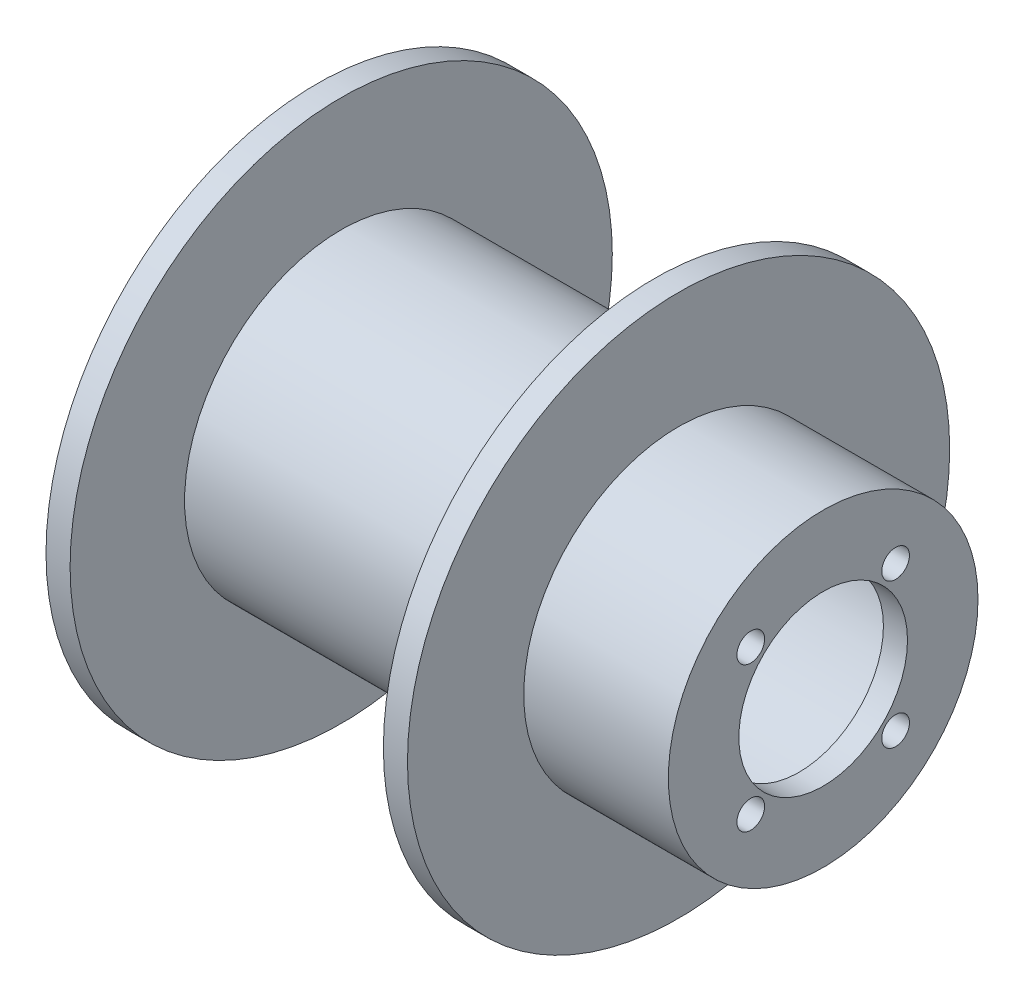
ISO-10303-21;
HEADER;
FILE_DESCRIPTION(('STEP AP214'),'2;1');
FILE_NAME('part.step','',(''),(''),'','','');
FILE_SCHEMA(('AUTOMOTIVE_DESIGN { 1 0 10303 214 1 1 1 1 }'));
ENDSEC;
DATA;
#1=APPLICATION_CONTEXT('core data for automotive mechanical design processes');
#2=APPLICATION_PROTOCOL_DEFINITION('international standard','automotive_design',2000,#1);
#3=PRODUCT_CONTEXT('',#1,'mechanical');
#4=PRODUCT('Part','Part','',(#3));
#5=PRODUCT_RELATED_PRODUCT_CATEGORY('part','',(#4));
#6=PRODUCT_DEFINITION_FORMATION('','',#4);
#7=PRODUCT_DEFINITION_CONTEXT('part definition',#1,'design');
#8=PRODUCT_DEFINITION('design','',#6,#7);
#9=PRODUCT_DEFINITION_SHAPE('','',#8);
#10=(LENGTH_UNIT() NAMED_UNIT(*) SI_UNIT(.MILLI.,.METRE.));
#11=(NAMED_UNIT(*) PLANE_ANGLE_UNIT() SI_UNIT($,.RADIAN.));
#12=(NAMED_UNIT(*) SI_UNIT($,.STERADIAN.) SOLID_ANGLE_UNIT());
#13=UNCERTAINTY_MEASURE_WITH_UNIT(LENGTH_MEASURE(1.E-05),#10,'distance_accuracy_value','');
#14=(GEOMETRIC_REPRESENTATION_CONTEXT(3) GLOBAL_UNCERTAINTY_ASSIGNED_CONTEXT((#13)) GLOBAL_UNIT_ASSIGNED_CONTEXT((#10,
#11,#12)) REPRESENTATION_CONTEXT('',''));
#15=CARTESIAN_POINT('',(0.,0.,0.));
#16=DIRECTION('',(0.,0.,1.));
#17=DIRECTION('',(1.,0.,0.));
#18=AXIS2_PLACEMENT_3D('',#15,#16,#17);
#19=CARTESIAN_POINT('',(-42.,0.,0.));
#20=DIRECTION('',(1.,0.,0.));
#21=DIRECTION('',(0.,0.,-1.));
#22=AXIS2_PLACEMENT_3D('',#19,#20,#21);
#23=CYLINDRICAL_SURFACE('',#22,22.5);
#24=CARTESIAN_POINT('',(-42.,0.,0.));
#25=DIRECTION('',(1.,0.,0.));
#26=DIRECTION('',(0.,0.,-1.));
#27=AXIS2_PLACEMENT_3D('',#24,#25,#26);
#28=CIRCLE('',#27,22.5);
#29=CARTESIAN_POINT('',(-42.,0.,-22.5));
#30=VERTEX_POINT('',#29);
#31=EDGE_CURVE('E12',#30,#30,#28,.T.);
#32=ORIENTED_EDGE('',*,*,#31,.T.);
#33=EDGE_LOOP('',(#32));
#34=FACE_BOUND('',#33,.T.);
#35=CARTESIAN_POINT('',(-40.,0.,0.));
#36=DIRECTION('',(1.,0.,0.));
#37=DIRECTION('',(0.,0.,-1.));
#38=AXIS2_PLACEMENT_3D('',#35,#36,#37);
#39=CIRCLE('',#38,22.5);
#40=CARTESIAN_POINT('',(-40.,0.,-22.5));
#41=VERTEX_POINT('',#40);
#42=EDGE_CURVE('E56',#41,#41,#39,.T.);
#43=ORIENTED_EDGE('',*,*,#42,.F.);
#44=EDGE_LOOP('',(#43));
#45=FACE_BOUND('',#44,.T.);
#46=ADVANCED_FACE('F53',(#34,#45),#23,.T.);
#47=CARTESIAN_POINT('',(-42.,0.,0.));
#48=DIRECTION('',(1.,0.,0.));
#49=DIRECTION('',(0.,0.,-1.));
#50=AXIS2_PLACEMENT_3D('',#47,#48,#49);
#51=PLANE('',#50);
#52=CARTESIAN_POINT('',(-42.,0.,0.));
#53=DIRECTION('',(1.,0.,0.));
#54=DIRECTION('',(0.,0.,-1.));
#55=AXIS2_PLACEMENT_3D('',#52,#53,#54);
#56=CIRCLE('',#55,12.);
#57=CARTESIAN_POINT('',(-42.,0.,-12.));
#58=VERTEX_POINT('',#57);
#59=EDGE_CURVE('E63',#58,#58,#56,.T.);
#60=ORIENTED_EDGE('',*,*,#59,.T.);
#61=EDGE_LOOP('',(#60));
#62=FACE_BOUND('',#61,.T.);
#63=ORIENTED_EDGE('',*,*,#31,.F.);
#64=EDGE_LOOP('',(#63));
#65=FACE_BOUND('',#64,.T.);
#66=ADVANCED_FACE('F71',(#62,#65),#51,.F.);
#67=CARTESIAN_POINT('',(-40.,0.,0.));
#68=DIRECTION('',(1.,0.,0.));
#69=DIRECTION('',(0.,0.,-1.));
#70=AXIS2_PLACEMENT_3D('',#67,#68,#69);
#71=PLANE('',#70);
#72=CARTESIAN_POINT('',(-40.,0.,0.));
#73=DIRECTION('',(1.,0.,0.));
#74=DIRECTION('',(0.,0.,-1.));
#75=AXIS2_PLACEMENT_3D('',#72,#73,#74);
#76=CIRCLE('',#75,12.);
#77=CARTESIAN_POINT('',(-40.,0.,-12.));
#78=VERTEX_POINT('',#77);
#79=EDGE_CURVE('E65',#78,#78,#76,.T.);
#80=ORIENTED_EDGE('',*,*,#79,.F.);
#81=EDGE_LOOP('',(#80));
#82=FACE_BOUND('',#81,.T.);
#83=ORIENTED_EDGE('',*,*,#42,.T.);
#84=EDGE_LOOP('',(#83));
#85=FACE_BOUND('',#84,.T.);
#86=ADVANCED_FACE('F77',(#82,#85),#71,.T.);
#87=CARTESIAN_POINT('',(-42.,0.,0.));
#88=DIRECTION('',(1.,0.,0.));
#89=DIRECTION('',(0.,0.,-1.));
#90=AXIS2_PLACEMENT_3D('',#87,#88,#89);
#91=CYLINDRICAL_SURFACE('',#90,12.);
#92=ORIENTED_EDGE('',*,*,#59,.F.);
#93=EDGE_LOOP('',(#92));
#94=FACE_BOUND('',#93,.T.);
#95=ORIENTED_EDGE('',*,*,#79,.T.);
#96=EDGE_LOOP('',(#95));
#97=FACE_BOUND('',#96,.T.);
#98=ADVANCED_FACE('F74',(#94,#97),#91,.F.);
#99=CLOSED_SHELL('',(#46,#66,#86,#98));
#100=MANIFOLD_SOLID_BREP('B2',#99);
#101=CARTESIAN_POINT('',(-14.,0.,0.));
#102=DIRECTION('',(1.,0.,0.));
#103=DIRECTION('',(0.,0.,-1.));
#104=AXIS2_PLACEMENT_3D('',#101,#102,#103);
#105=CYLINDRICAL_SURFACE('',#104,12.);
#106=CARTESIAN_POINT('',(-2.,0.,0.));
#107=DIRECTION('',(1.,0.,0.));
#108=DIRECTION('',(0.,0.,-1.));
#109=AXIS2_PLACEMENT_3D('',#106,#107,#108);
#110=CIRCLE('',#109,12.);
#111=CARTESIAN_POINT('',(-2.,0.,-12.));
#112=VERTEX_POINT('',#111);
#113=EDGE_CURVE('E131',#112,#112,#110,.F.);
#114=ORIENTED_EDGE('',*,*,#113,.F.);
#115=EDGE_LOOP('',(#114));
#116=FACE_BOUND('',#115,.T.);
#117=CARTESIAN_POINT('',(-40.,0.,0.));
#118=DIRECTION('',(1.,0.,0.));
#119=DIRECTION('',(0.,0.,-1.));
#120=AXIS2_PLACEMENT_3D('',#117,#118,#119);
#121=CIRCLE('',#120,12.);
#122=CARTESIAN_POINT('',(-40.,0.,-12.));
#123=VERTEX_POINT('',#122);
#124=EDGE_CURVE('E156',#123,#123,#121,.T.);
#125=ORIENTED_EDGE('',*,*,#124,.F.);
#126=EDGE_LOOP('',(#125));
#127=FACE_BOUND('',#126,.T.);
#128=ADVANCED_FACE('F123',(#116,#127),#105,.F.);
#129=CARTESIAN_POINT('',(-14.,0.,0.));
#130=DIRECTION('',(1.,0.,0.));
#131=DIRECTION('',(0.,0.,-1.));
#132=AXIS2_PLACEMENT_3D('',#129,#130,#131);
#133=CYLINDRICAL_SURFACE('',#132,12.85);
#134=CARTESIAN_POINT('',(-12.,0.,0.));
#135=DIRECTION('',(1.,0.,0.));
#136=DIRECTION('',(0.,0.,-1.));
#137=AXIS2_PLACEMENT_3D('',#134,#135,#136);
#138=CIRCLE('',#137,12.85);
#139=CARTESIAN_POINT('',(-12.,0.,-12.85));
#140=VERTEX_POINT('',#139);
#141=EDGE_CURVE('E52',#140,#140,#138,.F.);
#142=ORIENTED_EDGE('',*,*,#141,.F.);
#143=EDGE_LOOP('',(#142));
#144=FACE_BOUND('',#143,.T.);
#145=CARTESIAN_POINT('',(0.,0.,0.));
#146=DIRECTION('',(1.,0.,0.));
#147=DIRECTION('',(0.,0.,-1.));
#148=AXIS2_PLACEMENT_3D('',#145,#146,#147);
#149=CIRCLE('',#148,12.85);
#150=CARTESIAN_POINT('',(0.,0.,-12.85));
#151=VERTEX_POINT('',#150);
#152=EDGE_CURVE('E137',#151,#151,#149,.T.);
#153=ORIENTED_EDGE('',*,*,#152,.F.);
#154=EDGE_LOOP('',(#153));
#155=FACE_BOUND('',#154,.T.);
#156=ADVANCED_FACE('F205',(#144,#155),#133,.T.);
#157=CARTESIAN_POINT('',(-14.,0.,0.));
#158=DIRECTION('',(1.,0.,0.));
#159=DIRECTION('',(0.,0.,-1.));
#160=AXIS2_PLACEMENT_3D('',#157,#158,#159);
#161=PLANE('',#160);
#162=CARTESIAN_POINT('',(-14.,0.,0.));
#163=DIRECTION('',(1.,0.,0.));
#164=DIRECTION('',(0.,0.,-1.));
#165=AXIS2_PLACEMENT_3D('',#162,#163,#164);
#166=CIRCLE('',#165,13.);
#167=CARTESIAN_POINT('',(-14.,0.,-13.));
#168=VERTEX_POINT('',#167);
#169=EDGE_CURVE('E161',#168,#168,#166,.T.);
#170=ORIENTED_EDGE('',*,*,#169,.T.);
#171=EDGE_LOOP('',(#170));
#172=FACE_BOUND('',#171,.T.);
#173=CARTESIAN_POINT('',(-14.,0.,0.));
#174=DIRECTION('',(1.,0.,0.));
#175=DIRECTION('',(0.,0.,-1.));
#176=AXIS2_PLACEMENT_3D('',#173,#174,#175);
#177=CIRCLE('',#176,22.5);
#178=CARTESIAN_POINT('',(-14.,0.,-22.5));
#179=VERTEX_POINT('',#178);
#180=EDGE_CURVE('E174',#179,#179,#177,.T.);
#181=ORIENTED_EDGE('',*,*,#180,.F.);
#182=EDGE_LOOP('',(#181));
#183=FACE_BOUND('',#182,.T.);
#184=ADVANCED_FACE('F197',(#172,#183),#161,.F.);
#185=CARTESIAN_POINT('',(0.,0.,0.));
#186=DIRECTION('',(1.,0.,0.));
#187=DIRECTION('',(0.,0.,-1.));
#188=AXIS2_PLACEMENT_3D('',#185,#186,#187);
#189=PLANE('',#188);
#190=CARTESIAN_POINT('',(0.,6.01040764008529,6.01040764008567));
#191=DIRECTION('',(1.,0.,0.));
#192=DIRECTION('',(0.,0.,-1.));
#193=AXIS2_PLACEMENT_3D('',#190,#191,#192);
#194=CIRCLE('',#193,1.15);
#195=CARTESIAN_POINT('',(0.,6.01040764008529,4.86040764008567));
#196=VERTEX_POINT('',#195);
#197=EDGE_CURVE('E383',#196,#196,#194,.T.);
#198=ORIENTED_EDGE('',*,*,#197,.F.);
#199=EDGE_LOOP('',(#198));
#200=FACE_BOUND('',#199,.T.);
#201=CARTESIAN_POINT('',(0.,-6.01040764008602,6.01040764008529));
#202=DIRECTION('',(1.,0.,0.));
#203=DIRECTION('',(0.,0.,-1.));
#204=AXIS2_PLACEMENT_3D('',#201,#202,#203);
#205=CIRCLE('',#204,1.15);
#206=CARTESIAN_POINT('',(0.,-6.01040764008602,4.8604076400853));
#207=VERTEX_POINT('',#206);
#208=EDGE_CURVE('E385',#207,#207,#205,.T.);
#209=ORIENTED_EDGE('',*,*,#208,.F.);
#210=EDGE_LOOP('',(#209));
#211=FACE_BOUND('',#210,.T.);
#212=CARTESIAN_POINT('',(0.,-6.01040764008564,-6.01040764008601));
#213=DIRECTION('',(1.,0.,0.));
#214=DIRECTION('',(0.,0.,-1.));
#215=AXIS2_PLACEMENT_3D('',#212,#213,#214);
#216=CIRCLE('',#215,1.15);
#217=CARTESIAN_POINT('',(0.,-6.01040764008564,-7.16040764008601));
#218=VERTEX_POINT('',#217);
#219=EDGE_CURVE('E388',#218,#218,#216,.T.);
#220=ORIENTED_EDGE('',*,*,#219,.F.);
#221=EDGE_LOOP('',(#220));
#222=FACE_BOUND('',#221,.T.);
#223=CARTESIAN_POINT('',(0.,6.01040764008567,-6.01040764008564));
#224=DIRECTION('',(1.,0.,0.));
#225=DIRECTION('',(0.,0.,-1.));
#226=AXIS2_PLACEMENT_3D('',#223,#224,#225);
#227=CIRCLE('',#226,1.15);
#228=CARTESIAN_POINT('',(0.,6.01040764008567,-7.16040764008564));
#229=VERTEX_POINT('',#228);
#230=EDGE_CURVE('E146',#229,#229,#227,.T.);
#231=ORIENTED_EDGE('',*,*,#230,.F.);
#232=EDGE_LOOP('',(#231));
#233=FACE_BOUND('',#232,.T.);
#234=ORIENTED_EDGE('',*,*,#152,.T.);
#235=EDGE_LOOP('',(#234));
#236=FACE_BOUND('',#235,.T.);
#237=CARTESIAN_POINT('',(0.,0.,0.));
#238=DIRECTION('',(1.,0.,0.));
#239=DIRECTION('',(0.,0.,-1.));
#240=AXIS2_PLACEMENT_3D('',#237,#238,#239);
#241=CIRCLE('',#240,7.);
#242=CARTESIAN_POINT('',(0.,0.,-7.));
#243=VERTEX_POINT('',#242);
#244=EDGE_CURVE('E180',#243,#243,#241,.T.);
#245=ORIENTED_EDGE('',*,*,#244,.F.);
#246=EDGE_LOOP('',(#245));
#247=FACE_BOUND('',#246,.T.);
#248=ADVANCED_FACE('F194',(#200,#211,#222,#233,#236,#247),#189,.T.);
#249=CARTESIAN_POINT('',(-2.,0.,0.));
#250=DIRECTION('',(1.,0.,0.));
#251=DIRECTION('',(0.,0.,-1.));
#252=AXIS2_PLACEMENT_3D('',#249,#250,#251);
#253=PLANE('',#252);
#254=CARTESIAN_POINT('',(-2.,6.01040764008529,6.01040764008567));
#255=DIRECTION('',(1.,0.,0.));
#256=DIRECTION('',(0.,0.,-1.));
#257=AXIS2_PLACEMENT_3D('',#254,#255,#256);
#258=CIRCLE('',#257,1.15);
#259=CARTESIAN_POINT('',(-2.,6.01040764008529,4.86040764008567));
#260=VERTEX_POINT('',#259);
#261=EDGE_CURVE('E126',#260,#260,#258,.T.);
#262=ORIENTED_EDGE('',*,*,#261,.T.);
#263=EDGE_LOOP('',(#262));
#264=FACE_BOUND('',#263,.T.);
#265=CARTESIAN_POINT('',(-2.,-6.01040764008602,6.01040764008529));
#266=DIRECTION('',(1.,0.,0.));
#267=DIRECTION('',(0.,0.,-1.));
#268=AXIS2_PLACEMENT_3D('',#265,#266,#267);
#269=CIRCLE('',#268,1.15);
#270=CARTESIAN_POINT('',(-2.,-6.01040764008602,4.8604076400853));
#271=VERTEX_POINT('',#270);
#272=EDGE_CURVE('E149',#271,#271,#269,.T.);
#273=ORIENTED_EDGE('',*,*,#272,.T.);
#274=EDGE_LOOP('',(#273));
#275=FACE_BOUND('',#274,.T.);
#276=CARTESIAN_POINT('',(-2.,-6.01040764008564,-6.01040764008601));
#277=DIRECTION('',(1.,0.,0.));
#278=DIRECTION('',(0.,0.,-1.));
#279=AXIS2_PLACEMENT_3D('',#276,#277,#278);
#280=CIRCLE('',#279,1.15);
#281=CARTESIAN_POINT('',(-2.,-6.01040764008564,-7.16040764008601));
#282=VERTEX_POINT('',#281);
#283=EDGE_CURVE('E145',#282,#282,#280,.T.);
#284=ORIENTED_EDGE('',*,*,#283,.T.);
#285=EDGE_LOOP('',(#284));
#286=FACE_BOUND('',#285,.T.);
#287=CARTESIAN_POINT('',(-2.,6.01040764008567,-6.01040764008564));
#288=DIRECTION('',(1.,0.,0.));
#289=DIRECTION('',(0.,0.,-1.));
#290=AXIS2_PLACEMENT_3D('',#287,#288,#289);
#291=CIRCLE('',#290,1.15);
#292=CARTESIAN_POINT('',(-2.,6.01040764008567,-7.16040764008564));
#293=VERTEX_POINT('',#292);
#294=EDGE_CURVE('E141',#293,#293,#291,.T.);
#295=ORIENTED_EDGE('',*,*,#294,.T.);
#296=EDGE_LOOP('',(#295));
#297=FACE_BOUND('',#296,.T.);
#298=CARTESIAN_POINT('',(-2.,0.,0.));
#299=DIRECTION('',(1.,0.,0.));
#300=DIRECTION('',(0.,0.,-1.));
#301=AXIS2_PLACEMENT_3D('',#298,#299,#300);
#302=CIRCLE('',#301,7.);
#303=CARTESIAN_POINT('',(-2.,0.,-7.));
#304=VERTEX_POINT('',#303);
#305=EDGE_CURVE('E184',#304,#304,#302,.T.);
#306=ORIENTED_EDGE('',*,*,#305,.T.);
#307=EDGE_LOOP('',(#306));
#308=FACE_BOUND('',#307,.T.);
#309=ORIENTED_EDGE('',*,*,#113,.T.);
#310=EDGE_LOOP('',(#309));
#311=FACE_BOUND('',#310,.T.);
#312=ADVANCED_FACE('F196',(#264,#275,#286,#297,#308,#311),#253,.F.);
#313=CARTESIAN_POINT('',(-2.,0.,0.));
#314=DIRECTION('',(1.,0.,0.));
#315=DIRECTION('',(0.,0.,-1.));
#316=AXIS2_PLACEMENT_3D('',#313,#314,#315);
#317=CYLINDRICAL_SURFACE('',#316,7.);
#318=ORIENTED_EDGE('',*,*,#305,.F.);
#319=EDGE_LOOP('',(#318));
#320=FACE_BOUND('',#319,.T.);
#321=ORIENTED_EDGE('',*,*,#244,.T.);
#322=EDGE_LOOP('',(#321));
#323=FACE_BOUND('',#322,.T.);
#324=ADVANCED_FACE('F192',(#320,#323),#317,.F.);
#325=CARTESIAN_POINT('',(-12.,0.,0.));
#326=DIRECTION('',(1.,0.,0.));
#327=DIRECTION('',(0.,0.,-1.));
#328=AXIS2_PLACEMENT_3D('',#325,#326,#327);
#329=PLANE('',#328);
#330=ORIENTED_EDGE('',*,*,#141,.T.);
#331=EDGE_LOOP('',(#330));
#332=FACE_BOUND('',#331,.T.);
#333=CARTESIAN_POINT('',(-12.,0.,0.));
#334=DIRECTION('',(1.,0.,0.));
#335=DIRECTION('',(0.,0.,-1.));
#336=AXIS2_PLACEMENT_3D('',#333,#334,#335);
#337=CIRCLE('',#336,22.5);
#338=CARTESIAN_POINT('',(-12.,0.,-22.5));
#339=VERTEX_POINT('',#338);
#340=EDGE_CURVE('E176',#339,#339,#337,.T.);
#341=ORIENTED_EDGE('',*,*,#340,.T.);
#342=EDGE_LOOP('',(#341));
#343=FACE_BOUND('',#342,.T.);
#344=ADVANCED_FACE('F333',(#332,#343),#329,.T.);
#345=CARTESIAN_POINT('',(-12.,0.,0.));
#346=DIRECTION('',(-1.,0.,0.));
#347=DIRECTION('',(0.,0.,1.));
#348=AXIS2_PLACEMENT_3D('',#345,#346,#347);
#349=CYLINDRICAL_SURFACE('',#348,22.5);
#350=ORIENTED_EDGE('',*,*,#340,.F.);
#351=EDGE_LOOP('',(#350));
#352=FACE_BOUND('',#351,.T.);
#353=ORIENTED_EDGE('',*,*,#180,.T.);
#354=EDGE_LOOP('',(#353));
#355=FACE_BOUND('',#354,.T.);
#356=ADVANCED_FACE('F249',(#352,#355),#349,.T.);
#357=CARTESIAN_POINT('',(-40.,0.,0.));
#358=DIRECTION('',(1.,0.,0.));
#359=DIRECTION('',(0.,0.,-1.));
#360=AXIS2_PLACEMENT_3D('',#357,#358,#359);
#361=CYLINDRICAL_SURFACE('',#360,13.);
#362=CARTESIAN_POINT('',(-40.,0.,0.));
#363=DIRECTION('',(1.,0.,0.));
#364=DIRECTION('',(0.,0.,-1.));
#365=AXIS2_PLACEMENT_3D('',#362,#363,#364);
#366=CIRCLE('',#365,13.);
#367=CARTESIAN_POINT('',(-40.,0.,-13.));
#368=VERTEX_POINT('',#367);
#369=EDGE_CURVE('E167',#368,#368,#366,.T.);
#370=ORIENTED_EDGE('',*,*,#369,.T.);
#371=EDGE_LOOP('',(#370));
#372=FACE_BOUND('',#371,.T.);
#373=ORIENTED_EDGE('',*,*,#169,.F.);
#374=EDGE_LOOP('',(#373));
#375=FACE_BOUND('',#374,.T.);
#376=ADVANCED_FACE('F243',(#372,#375),#361,.T.);
#377=CARTESIAN_POINT('',(-40.,0.,0.));
#378=DIRECTION('',(1.,0.,0.));
#379=DIRECTION('',(0.,0.,-1.));
#380=AXIS2_PLACEMENT_3D('',#377,#378,#379);
#381=PLANE('',#380);
#382=ORIENTED_EDGE('',*,*,#124,.T.);
#383=EDGE_LOOP('',(#382));
#384=FACE_BOUND('',#383,.T.);
#385=ORIENTED_EDGE('',*,*,#369,.F.);
#386=EDGE_LOOP('',(#385));
#387=FACE_BOUND('',#386,.T.);
#388=ADVANCED_FACE('F248',(#384,#387),#381,.F.);
#389=CARTESIAN_POINT('',(-42.,6.01040764008567,-6.01040764008564));
#390=DIRECTION('',(1.,0.,0.));
#391=DIRECTION('',(0.,0.,-1.));
#392=AXIS2_PLACEMENT_3D('',#389,#390,#391);
#393=CYLINDRICAL_SURFACE('',#392,1.15);
#394=ORIENTED_EDGE('',*,*,#230,.T.);
#395=EDGE_LOOP('',(#394));
#396=FACE_BOUND('',#395,.T.);
#397=ORIENTED_EDGE('',*,*,#294,.F.);
#398=EDGE_LOOP('',(#397));
#399=FACE_BOUND('',#398,.T.);
#400=ADVANCED_FACE('F260',(#396,#399),#393,.F.);
#401=CARTESIAN_POINT('',(-42.,-6.01040764008564,-6.01040764008601));
#402=DIRECTION('',(1.,0.,0.));
#403=DIRECTION('',(0.,0.,-1.));
#404=AXIS2_PLACEMENT_3D('',#401,#402,#403);
#405=CYLINDRICAL_SURFACE('',#404,1.15);
#406=ORIENTED_EDGE('',*,*,#219,.T.);
#407=EDGE_LOOP('',(#406));
#408=FACE_BOUND('',#407,.T.);
#409=ORIENTED_EDGE('',*,*,#283,.F.);
#410=EDGE_LOOP('',(#409));
#411=FACE_BOUND('',#410,.T.);
#412=ADVANCED_FACE('F285',(#408,#411),#405,.F.);
#413=CARTESIAN_POINT('',(-42.,-6.01040764008602,6.01040764008529));
#414=DIRECTION('',(1.,0.,0.));
#415=DIRECTION('',(0.,0.,-1.));
#416=AXIS2_PLACEMENT_3D('',#413,#414,#415);
#417=CYLINDRICAL_SURFACE('',#416,1.15);
#418=ORIENTED_EDGE('',*,*,#208,.T.);
#419=EDGE_LOOP('',(#418));
#420=FACE_BOUND('',#419,.T.);
#421=ORIENTED_EDGE('',*,*,#272,.F.);
#422=EDGE_LOOP('',(#421));
#423=FACE_BOUND('',#422,.T.);
#424=ADVANCED_FACE('F296',(#420,#423),#417,.F.);
#425=CARTESIAN_POINT('',(-42.,6.01040764008529,6.01040764008567));
#426=DIRECTION('',(1.,0.,0.));
#427=DIRECTION('',(0.,0.,-1.));
#428=AXIS2_PLACEMENT_3D('',#425,#426,#427);
#429=CYLINDRICAL_SURFACE('',#428,1.15);
#430=ORIENTED_EDGE('',*,*,#197,.T.);
#431=EDGE_LOOP('',(#430));
#432=FACE_BOUND('',#431,.T.);
#433=ORIENTED_EDGE('',*,*,#261,.F.);
#434=EDGE_LOOP('',(#433));
#435=FACE_BOUND('',#434,.T.);
#436=ADVANCED_FACE('F307',(#432,#435),#429,.F.);
#437=CLOSED_SHELL('',(#128,#156,#184,#248,#312,#324,#344,#356,#376,#388,#400,#412,#424,#436));
#438=MANIFOLD_SOLID_BREP('B7',#437);
#439=ADVANCED_BREP_SHAPE_REPRESENTATION('',(#18,#100,#438),#14);
#440=SHAPE_DEFINITION_REPRESENTATION(#9,#439);
ENDSEC;
END-ISO-10303-21;
